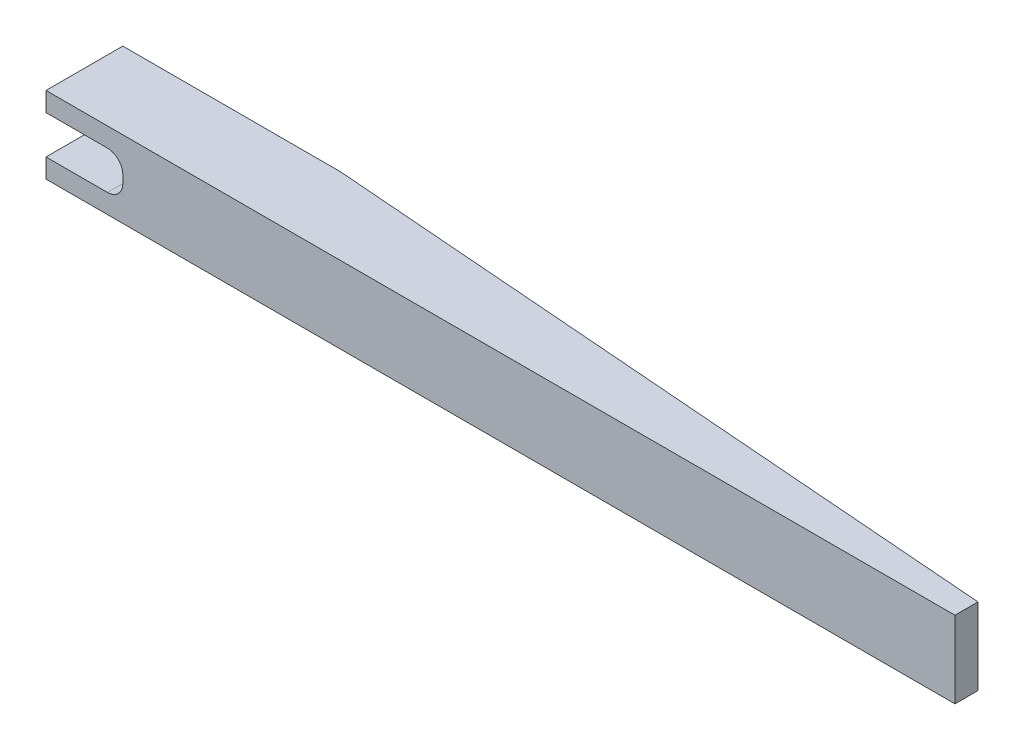
ISO-10303-21;
HEADER;
FILE_DESCRIPTION(('STEP AP214'),'2;1');
FILE_NAME('part.step','',(''),(''),'','','');
FILE_SCHEMA(('AUTOMOTIVE_DESIGN { 1 0 10303 214 1 1 1 1 }'));
ENDSEC;
DATA;
#1=APPLICATION_CONTEXT('core data for automotive mechanical design processes');
#2=APPLICATION_PROTOCOL_DEFINITION('international standard','automotive_design',2000,#1);
#3=PRODUCT_CONTEXT('',#1,'mechanical');
#4=PRODUCT('Part','Part','',(#3));
#5=PRODUCT_RELATED_PRODUCT_CATEGORY('part','',(#4));
#6=PRODUCT_DEFINITION_FORMATION('','',#4);
#7=PRODUCT_DEFINITION_CONTEXT('part definition',#1,'design');
#8=PRODUCT_DEFINITION('design','',#6,#7);
#9=PRODUCT_DEFINITION_SHAPE('','',#8);
#10=(LENGTH_UNIT() NAMED_UNIT(*) SI_UNIT(.MILLI.,.METRE.));
#11=(NAMED_UNIT(*) PLANE_ANGLE_UNIT() SI_UNIT($,.RADIAN.));
#12=(NAMED_UNIT(*) SI_UNIT($,.STERADIAN.) SOLID_ANGLE_UNIT());
#13=UNCERTAINTY_MEASURE_WITH_UNIT(LENGTH_MEASURE(1.E-05),#10,'distance_accuracy_value','');
#14=(GEOMETRIC_REPRESENTATION_CONTEXT(3) GLOBAL_UNCERTAINTY_ASSIGNED_CONTEXT((#13)) GLOBAL_UNIT_ASSIGNED_CONTEXT((#10,
#11,#12)) REPRESENTATION_CONTEXT('',''));
#15=CARTESIAN_POINT('',(0.,0.,0.));
#16=DIRECTION('',(0.,0.,1.));
#17=DIRECTION('',(1.,0.,0.));
#18=AXIS2_PLACEMENT_3D('',#15,#16,#17);
#19=CARTESIAN_POINT('',(-59.175,5.,10.));
#20=DIRECTION('',(1.,0.,0.));
#21=DIRECTION('',(0.,0.,-1.));
#22=AXIS2_PLACEMENT_3D('',#19,#20,#21);
#23=PLANE('',#22);
#24=DIRECTION('',(0.,-1.,0.));
#25=VECTOR('',#24,1.);
#26=CARTESIAN_POINT('',(-59.175,5.,10.));
#27=LINE('',#26,#25);
#28=CARTESIAN_POINT('',(-59.175,-2.5,10.));
#29=VERTEX_POINT('',#28);
#30=CARTESIAN_POINT('',(-59.175,-5.,10.));
#31=VERTEX_POINT('',#30);
#32=EDGE_CURVE('E246',#29,#31,#27,.T.);
#33=ORIENTED_EDGE('',*,*,#32,.F.);
#34=DIRECTION('',(0.,0.,-1.));
#35=VECTOR('',#34,1.);
#36=CARTESIAN_POINT('',(-59.175,-2.5,10.));
#37=LINE('',#36,#35);
#38=CARTESIAN_POINT('',(-59.175,-2.5,0.));
#39=VERTEX_POINT('',#38);
#40=EDGE_CURVE('E236',#29,#39,#37,.T.);
#41=ORIENTED_EDGE('',*,*,#40,.T.);
#42=DIRECTION('',(0.,-1.,0.));
#43=VECTOR('',#42,1.);
#44=CARTESIAN_POINT('',(-59.175,5.,0.));
#45=LINE('',#44,#43);
#46=CARTESIAN_POINT('',(-59.175,-5.,0.));
#47=VERTEX_POINT('',#46);
#48=EDGE_CURVE('E250',#39,#47,#45,.T.);
#49=ORIENTED_EDGE('',*,*,#48,.T.);
#50=DIRECTION('',(0.,0.,-1.));
#51=VECTOR('',#50,1.);
#52=CARTESIAN_POINT('',(-59.175,-5.,10.));
#53=LINE('',#52,#51);
#54=EDGE_CURVE('E155',#31,#47,#53,.T.);
#55=ORIENTED_EDGE('',*,*,#54,.F.);
#56=EDGE_LOOP('',(#33,#41,#49,#55));
#57=FACE_BOUND('',#56,.T.);
#58=ADVANCED_FACE('F42',(#57),#23,.F.);
#59=CARTESIAN_POINT('',(59.175,5.,10.));
#60=DIRECTION('',(-1.,0.,0.));
#61=DIRECTION('',(0.,-1.,0.));
#62=AXIS2_PLACEMENT_3D('',#59,#60,#61);
#63=PLANE('',#62);
#64=DIRECTION('',(0.,0.,-1.));
#65=VECTOR('',#64,1.);
#66=CARTESIAN_POINT('',(59.175,-5.,10.));
#67=LINE('',#66,#65);
#68=CARTESIAN_POINT('',(59.175,-5.,10.));
#69=VERTEX_POINT('',#68);
#70=CARTESIAN_POINT('',(59.175,-5.,7.));
#71=VERTEX_POINT('',#70);
#72=EDGE_CURVE('E144',#69,#71,#67,.T.);
#73=ORIENTED_EDGE('',*,*,#72,.T.);
#74=DIRECTION('',(0.,1.,0.));
#75=VECTOR('',#74,1.);
#76=CARTESIAN_POINT('',(59.175,-5.,7.));
#77=LINE('',#76,#75);
#78=CARTESIAN_POINT('',(59.175,5.,7.));
#79=VERTEX_POINT('',#78);
#80=EDGE_CURVE('E124',#71,#79,#77,.T.);
#81=ORIENTED_EDGE('',*,*,#80,.T.);
#82=DIRECTION('',(0.,0.,-1.));
#83=VECTOR('',#82,1.);
#84=CARTESIAN_POINT('',(59.175,5.,10.));
#85=LINE('',#84,#83);
#86=CARTESIAN_POINT('',(59.175,5.,10.));
#87=VERTEX_POINT('',#86);
#88=EDGE_CURVE('E170',#87,#79,#85,.T.);
#89=ORIENTED_EDGE('',*,*,#88,.F.);
#90=DIRECTION('',(0.,1.,0.));
#91=VECTOR('',#90,1.);
#92=CARTESIAN_POINT('',(59.175,5.,10.));
#93=LINE('',#92,#91);
#94=EDGE_CURVE('E153',#69,#87,#93,.T.);
#95=ORIENTED_EDGE('',*,*,#94,.F.);
#96=EDGE_LOOP('',(#73,#81,#89,#95));
#97=FACE_BOUND('',#96,.T.);
#98=ADVANCED_FACE('F151',(#97),#63,.F.);
#99=CARTESIAN_POINT('',(-59.175,5.,10.));
#100=DIRECTION('',(0.,-1.,0.));
#101=DIRECTION('',(0.,0.,-1.));
#102=AXIS2_PLACEMENT_3D('',#99,#100,#101);
#103=PLANE('',#102);
#104=ORIENTED_EDGE('',*,*,#88,.T.);
#105=DIRECTION('',(0.996988962962474,0.,0.0775435860081924));
#106=VECTOR('',#105,1.);
#107=CARTESIAN_POINT('',(59.175,5.,7.));
#108=LINE('',#107,#106);
#109=CARTESIAN_POINT('',(-30.825,5.,0.));
#110=VERTEX_POINT('',#109);
#111=EDGE_CURVE('E130',#110,#79,#108,.T.);
#112=ORIENTED_EDGE('',*,*,#111,.F.);
#113=DIRECTION('',(-1.,0.,0.));
#114=VECTOR('',#113,1.);
#115=CARTESIAN_POINT('',(-59.175,5.,0.));
#116=LINE('',#115,#114);
#117=CARTESIAN_POINT('',(-59.175,5.,0.));
#118=VERTEX_POINT('',#117);
#119=EDGE_CURVE('E240',#110,#118,#116,.T.);
#120=ORIENTED_EDGE('',*,*,#119,.T.);
#121=DIRECTION('',(0.,0.,-1.));
#122=VECTOR('',#121,1.);
#123=CARTESIAN_POINT('',(-59.175,5.,10.));
#124=LINE('',#123,#122);
#125=CARTESIAN_POINT('',(-59.175,5.,10.));
#126=VERTEX_POINT('',#125);
#127=EDGE_CURVE('E160',#126,#118,#124,.T.);
#128=ORIENTED_EDGE('',*,*,#127,.F.);
#129=DIRECTION('',(-1.,0.,0.));
#130=VECTOR('',#129,1.);
#131=CARTESIAN_POINT('',(-59.175,5.,10.));
#132=LINE('',#131,#130);
#133=EDGE_CURVE('E243',#87,#126,#132,.T.);
#134=ORIENTED_EDGE('',*,*,#133,.F.);
#135=EDGE_LOOP('',(#104,#112,#120,#128,#134));
#136=FACE_BOUND('',#135,.T.);
#137=ADVANCED_FACE('F266',(#136),#103,.F.);
#138=CARTESIAN_POINT('',(-59.175,2.5,0.));
#139=VERTEX_POINT('',#138);
#140=EDGE_CURVE('E251',#118,#139,#45,.T.);
#141=ORIENTED_EDGE('',*,*,#140,.T.);
#142=DIRECTION('',(0.,0.,1.));
#143=VECTOR('',#142,1.);
#144=CARTESIAN_POINT('',(-59.175,2.5,10.));
#145=LINE('',#144,#143);
#146=CARTESIAN_POINT('',(-59.175,2.5,10.));
#147=VERTEX_POINT('',#146);
#148=EDGE_CURVE('E213',#139,#147,#145,.T.);
#149=ORIENTED_EDGE('',*,*,#148,.T.);
#150=EDGE_CURVE('E162',#126,#147,#27,.T.);
#151=ORIENTED_EDGE('',*,*,#150,.F.);
#152=ORIENTED_EDGE('',*,*,#127,.T.);
#153=EDGE_LOOP('',(#141,#149,#151,#152));
#154=FACE_BOUND('',#153,.T.);
#155=ADVANCED_FACE('F279',(#154),#23,.F.);
#156=CARTESIAN_POINT('',(-59.175,-5.,10.));
#157=DIRECTION('',(0.,1.,0.));
#158=DIRECTION('',(0.,0.,1.));
#159=AXIS2_PLACEMENT_3D('',#156,#157,#158);
#160=PLANE('',#159);
#161=DIRECTION('',(1.,0.,0.));
#162=VECTOR('',#161,1.);
#163=CARTESIAN_POINT('',(-59.175,-5.,0.));
#164=LINE('',#163,#162);
#165=CARTESIAN_POINT('',(-30.825,-5.,0.));
#166=VERTEX_POINT('',#165);
#167=EDGE_CURVE('E148',#47,#166,#164,.T.);
#168=ORIENTED_EDGE('',*,*,#167,.T.);
#169=DIRECTION('',(0.996988962962474,0.,0.0775435860081924));
#170=VECTOR('',#169,1.);
#171=CARTESIAN_POINT('',(59.175,-5.,7.));
#172=LINE('',#171,#170);
#173=EDGE_CURVE('E127',#166,#71,#172,.T.);
#174=ORIENTED_EDGE('',*,*,#173,.T.);
#175=ORIENTED_EDGE('',*,*,#72,.F.);
#176=DIRECTION('',(1.,0.,0.));
#177=VECTOR('',#176,1.);
#178=CARTESIAN_POINT('',(-59.175,-5.,10.));
#179=LINE('',#178,#177);
#180=EDGE_CURVE('E156',#31,#69,#179,.T.);
#181=ORIENTED_EDGE('',*,*,#180,.F.);
#182=ORIENTED_EDGE('',*,*,#54,.T.);
#183=EDGE_LOOP('',(#168,#174,#175,#181,#182));
#184=FACE_BOUND('',#183,.T.);
#185=ADVANCED_FACE('F142',(#184),#160,.F.);
#186=CARTESIAN_POINT('',(0.,0.,10.));
#187=DIRECTION('',(0.,0.,1.));
#188=DIRECTION('',(1.,0.,0.));
#189=AXIS2_PLACEMENT_3D('',#186,#187,#188);
#190=PLANE('',#189);
#191=DIRECTION('',(1.,0.,0.));
#192=VECTOR('',#191,1.);
#193=CARTESIAN_POINT('',(-69.175,-2.5,10.));
#194=LINE('',#193,#192);
#195=CARTESIAN_POINT('',(-51.175,-2.5,10.));
#196=VERTEX_POINT('',#195);
#197=EDGE_CURVE('E228',#29,#196,#194,.T.);
#198=ORIENTED_EDGE('',*,*,#197,.F.);
#199=ORIENTED_EDGE('',*,*,#32,.T.);
#200=ORIENTED_EDGE('',*,*,#180,.T.);
#201=ORIENTED_EDGE('',*,*,#94,.T.);
#202=ORIENTED_EDGE('',*,*,#133,.T.);
#203=ORIENTED_EDGE('',*,*,#150,.T.);
#204=DIRECTION('',(-1.,0.,0.));
#205=VECTOR('',#204,1.);
#206=CARTESIAN_POINT('',(-69.175,2.5,10.));
#207=LINE('',#206,#205);
#208=CARTESIAN_POINT('',(-51.175,2.5,10.));
#209=VERTEX_POINT('',#208);
#210=EDGE_CURVE('E221',#209,#147,#207,.T.);
#211=ORIENTED_EDGE('',*,*,#210,.F.);
#212=CARTESIAN_POINT('',(-51.175,0.500000000000001,10.));
#213=DIRECTION('',(0.,0.,1.));
#214=DIRECTION('',(1.,0.,0.));
#215=AXIS2_PLACEMENT_3D('',#212,#213,#214);
#216=CIRCLE('',#215,2.);
#217=CARTESIAN_POINT('',(-49.175,0.500000000000001,10.));
#218=VERTEX_POINT('',#217);
#219=EDGE_CURVE('E189',#209,#218,#216,.F.);
#220=ORIENTED_EDGE('',*,*,#219,.T.);
#221=DIRECTION('',(0.,1.,0.));
#222=VECTOR('',#221,1.);
#223=CARTESIAN_POINT('',(-49.175,2.5,10.));
#224=LINE('',#223,#222);
#225=CARTESIAN_POINT('',(-49.175,-0.499999999999999,10.));
#226=VERTEX_POINT('',#225);
#227=EDGE_CURVE('E136',#226,#218,#224,.T.);
#228=ORIENTED_EDGE('',*,*,#227,.F.);
#229=CARTESIAN_POINT('',(-51.175,-0.499999999999999,10.));
#230=DIRECTION('',(0.,0.,1.));
#231=DIRECTION('',(1.,0.,0.));
#232=AXIS2_PLACEMENT_3D('',#229,#230,#231);
#233=CIRCLE('',#232,2.);
#234=EDGE_CURVE('E51',#226,#196,#233,.F.);
#235=ORIENTED_EDGE('',*,*,#234,.T.);
#236=EDGE_LOOP('',(#198,#199,#200,#201,#202,#203,#211,#220,#228,#235));
#237=FACE_BOUND('',#236,.T.);
#238=ADVANCED_FACE('F219',(#237),#190,.T.);
#239=CARTESIAN_POINT('',(0.,0.,0.));
#240=DIRECTION('',(0.,0.,1.));
#241=DIRECTION('',(1.,0.,0.));
#242=AXIS2_PLACEMENT_3D('',#239,#240,#241);
#243=PLANE('',#242);
#244=ORIENTED_EDGE('',*,*,#119,.F.);
#245=DIRECTION('',(0.,1.,0.));
#246=VECTOR('',#245,1.);
#247=CARTESIAN_POINT('',(-30.825,-5.,0.));
#248=LINE('',#247,#246);
#249=EDGE_CURVE('E137',#166,#110,#248,.T.);
#250=ORIENTED_EDGE('',*,*,#249,.F.);
#251=ORIENTED_EDGE('',*,*,#167,.F.);
#252=ORIENTED_EDGE('',*,*,#48,.F.);
#253=DIRECTION('',(1.,0.,0.));
#254=VECTOR('',#253,1.);
#255=CARTESIAN_POINT('',(0.,-2.5,0.));
#256=LINE('',#255,#254);
#257=CARTESIAN_POINT('',(-51.175,-2.5,0.));
#258=VERTEX_POINT('',#257);
#259=EDGE_CURVE('E173',#39,#258,#256,.T.);
#260=ORIENTED_EDGE('',*,*,#259,.T.);
#261=CARTESIAN_POINT('',(-51.175,-0.499999999999999,0.));
#262=DIRECTION('',(0.,0.,1.));
#263=DIRECTION('',(1.,0.,0.));
#264=AXIS2_PLACEMENT_3D('',#261,#262,#263);
#265=CIRCLE('',#264,2.);
#266=CARTESIAN_POINT('',(-49.175,-0.499999999999999,0.));
#267=VERTEX_POINT('',#266);
#268=EDGE_CURVE('E11',#258,#267,#265,.T.);
#269=ORIENTED_EDGE('',*,*,#268,.T.);
#270=DIRECTION('',(0.,1.,0.));
#271=VECTOR('',#270,1.);
#272=CARTESIAN_POINT('',(-49.175,2.5,0.));
#273=LINE('',#272,#271);
#274=CARTESIAN_POINT('',(-49.175,0.500000000000001,0.));
#275=VERTEX_POINT('',#274);
#276=EDGE_CURVE('E205',#267,#275,#273,.T.);
#277=ORIENTED_EDGE('',*,*,#276,.T.);
#278=CARTESIAN_POINT('',(-51.175,0.500000000000001,0.));
#279=DIRECTION('',(0.,0.,1.));
#280=DIRECTION('',(1.,0.,0.));
#281=AXIS2_PLACEMENT_3D('',#278,#279,#280);
#282=CIRCLE('',#281,2.);
#283=CARTESIAN_POINT('',(-51.175,2.5,0.));
#284=VERTEX_POINT('',#283);
#285=EDGE_CURVE('E192',#275,#284,#282,.T.);
#286=ORIENTED_EDGE('',*,*,#285,.T.);
#287=DIRECTION('',(-1.,0.,0.));
#288=VECTOR('',#287,1.);
#289=CARTESIAN_POINT('',(-69.175,2.5,0.));
#290=LINE('',#289,#288);
#291=EDGE_CURVE('E202',#284,#139,#290,.T.);
#292=ORIENTED_EDGE('',*,*,#291,.T.);
#293=ORIENTED_EDGE('',*,*,#140,.F.);
#294=EDGE_LOOP('',(#244,#250,#251,#252,#260,#269,#277,#286,#292,#293));
#295=FACE_BOUND('',#294,.T.);
#296=ADVANCED_FACE('F200',(#295),#243,.F.);
#297=CARTESIAN_POINT('',(-69.175,-2.5,0.));
#298=DIRECTION('',(0.,-1.,0.));
#299=DIRECTION('',(0.,0.,-1.));
#300=AXIS2_PLACEMENT_3D('',#297,#298,#299);
#301=PLANE('',#300);
#302=ORIENTED_EDGE('',*,*,#197,.T.);
#303=DIRECTION('',(0.,0.,1.));
#304=VECTOR('',#303,1.);
#305=CARTESIAN_POINT('',(-51.175,-2.5,0.));
#306=LINE('',#305,#304);
#307=EDGE_CURVE('E58',#196,#258,#306,.F.);
#308=ORIENTED_EDGE('',*,*,#307,.T.);
#309=ORIENTED_EDGE('',*,*,#259,.F.);
#310=ORIENTED_EDGE('',*,*,#40,.F.);
#311=EDGE_LOOP('',(#302,#308,#309,#310));
#312=FACE_BOUND('',#311,.T.);
#313=ADVANCED_FACE('F270',(#312),#301,.F.);
#314=CARTESIAN_POINT('',(-69.175,2.5,0.));
#315=DIRECTION('',(0.,1.,0.));
#316=DIRECTION('',(0.,0.,1.));
#317=AXIS2_PLACEMENT_3D('',#314,#315,#316);
#318=PLANE('',#317);
#319=ORIENTED_EDGE('',*,*,#291,.F.);
#320=DIRECTION('',(0.,0.,1.));
#321=VECTOR('',#320,1.);
#322=CARTESIAN_POINT('',(-51.175,2.5,10.));
#323=LINE('',#322,#321);
#324=EDGE_CURVE('E176',#284,#209,#323,.T.);
#325=ORIENTED_EDGE('',*,*,#324,.T.);
#326=ORIENTED_EDGE('',*,*,#210,.T.);
#327=ORIENTED_EDGE('',*,*,#148,.F.);
#328=EDGE_LOOP('',(#319,#325,#326,#327));
#329=FACE_BOUND('',#328,.T.);
#330=ADVANCED_FACE('F210',(#329),#318,.F.);
#331=CARTESIAN_POINT('',(-49.175,2.5,0.));
#332=DIRECTION('',(1.,0.,0.));
#333=DIRECTION('',(0.,0.,-1.));
#334=AXIS2_PLACEMENT_3D('',#331,#332,#333);
#335=PLANE('',#334);
#336=ORIENTED_EDGE('',*,*,#227,.T.);
#337=DIRECTION('',(0.,0.,1.));
#338=VECTOR('',#337,1.);
#339=CARTESIAN_POINT('',(-49.175,0.500000000000001,0.));
#340=LINE('',#339,#338);
#341=EDGE_CURVE('E184',#218,#275,#340,.F.);
#342=ORIENTED_EDGE('',*,*,#341,.T.);
#343=ORIENTED_EDGE('',*,*,#276,.F.);
#344=DIRECTION('',(0.,0.,1.));
#345=VECTOR('',#344,1.);
#346=CARTESIAN_POINT('',(-49.175,-0.499999999999999,10.));
#347=LINE('',#346,#345);
#348=EDGE_CURVE('E180',#267,#226,#347,.T.);
#349=ORIENTED_EDGE('',*,*,#348,.T.);
#350=EDGE_LOOP('',(#336,#342,#343,#349));
#351=FACE_BOUND('',#350,.T.);
#352=ADVANCED_FACE('F223',(#351),#335,.F.);
#353=CARTESIAN_POINT('',(59.175,-5.,7.));
#354=DIRECTION('',(-0.0775435860081924,0.,0.996988962962474));
#355=DIRECTION('',(0.996988962962474,0.,0.0775435860081924));
#356=AXIS2_PLACEMENT_3D('',#353,#354,#355);
#357=PLANE('',#356);
#358=ORIENTED_EDGE('',*,*,#111,.T.);
#359=ORIENTED_EDGE('',*,*,#80,.F.);
#360=ORIENTED_EDGE('',*,*,#173,.F.);
#361=ORIENTED_EDGE('',*,*,#249,.T.);
#362=EDGE_LOOP('',(#358,#359,#360,#361));
#363=FACE_BOUND('',#362,.T.);
#364=ADVANCED_FACE('F126',(#363),#357,.F.);
#365=CARTESIAN_POINT('',(-51.175,0.500000000000001,0.));
#366=DIRECTION('',(0.,0.,-1.));
#367=DIRECTION('',(-1.,0.,0.));
#368=AXIS2_PLACEMENT_3D('',#365,#366,#367);
#369=CYLINDRICAL_SURFACE('',#368,2.);
#370=ORIENTED_EDGE('',*,*,#285,.F.);
#371=ORIENTED_EDGE('',*,*,#341,.F.);
#372=ORIENTED_EDGE('',*,*,#219,.F.);
#373=ORIENTED_EDGE('',*,*,#324,.F.);
#374=EDGE_LOOP('',(#370,#371,#372,#373));
#375=FACE_BOUND('',#374,.T.);
#376=ADVANCED_FACE('F217',(#375),#369,.F.);
#377=CARTESIAN_POINT('',(-51.175,-0.499999999999999,0.));
#378=DIRECTION('',(0.,0.,-1.));
#379=DIRECTION('',(-1.,0.,0.));
#380=AXIS2_PLACEMENT_3D('',#377,#378,#379);
#381=CYLINDRICAL_SURFACE('',#380,2.);
#382=ORIENTED_EDGE('',*,*,#268,.F.);
#383=ORIENTED_EDGE('',*,*,#307,.F.);
#384=ORIENTED_EDGE('',*,*,#234,.F.);
#385=ORIENTED_EDGE('',*,*,#348,.F.);
#386=EDGE_LOOP('',(#382,#383,#384,#385));
#387=FACE_BOUND('',#386,.T.);
#388=ADVANCED_FACE('F44',(#387),#381,.F.);
#389=CLOSED_SHELL('',(#58,#98,#137,#155,#185,#238,#296,#313,#330,#352,#364,#376,#388));
#390=MANIFOLD_SOLID_BREP('B2',#389);
#391=ADVANCED_BREP_SHAPE_REPRESENTATION('',(#18,#390),#14);
#392=SHAPE_DEFINITION_REPRESENTATION(#9,#391);
ENDSEC;
END-ISO-10303-21;
